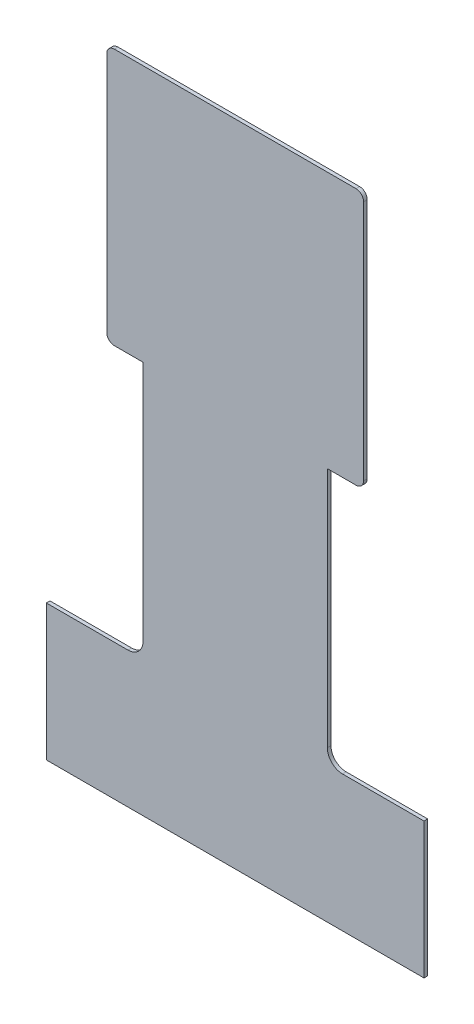
ISO-10303-21;
HEADER;
FILE_DESCRIPTION(('STEP AP214'),'2;1');
FILE_NAME('part.step','',(''),(''),'','','');
FILE_SCHEMA(('AUTOMOTIVE_DESIGN { 1 0 10303 214 1 1 1 1 }'));
ENDSEC;
DATA;
#1=APPLICATION_CONTEXT('core data for automotive mechanical design processes');
#2=APPLICATION_PROTOCOL_DEFINITION('international standard','automotive_design',2000,#1);
#3=PRODUCT_CONTEXT('',#1,'mechanical');
#4=PRODUCT('Part','Part','',(#3));
#5=PRODUCT_RELATED_PRODUCT_CATEGORY('part','',(#4));
#6=PRODUCT_DEFINITION_FORMATION('','',#4);
#7=PRODUCT_DEFINITION_CONTEXT('part definition',#1,'design');
#8=PRODUCT_DEFINITION('design','',#6,#7);
#9=PRODUCT_DEFINITION_SHAPE('','',#8);
#10=(LENGTH_UNIT() NAMED_UNIT(*) SI_UNIT(.MILLI.,.METRE.));
#11=(NAMED_UNIT(*) PLANE_ANGLE_UNIT() SI_UNIT($,.RADIAN.));
#12=(NAMED_UNIT(*) SI_UNIT($,.STERADIAN.) SOLID_ANGLE_UNIT());
#13=UNCERTAINTY_MEASURE_WITH_UNIT(LENGTH_MEASURE(1.E-05),#10,'distance_accuracy_value','');
#14=(GEOMETRIC_REPRESENTATION_CONTEXT(3) GLOBAL_UNCERTAINTY_ASSIGNED_CONTEXT((#13)) GLOBAL_UNIT_ASSIGNED_CONTEXT((#10,
#11,#12)) REPRESENTATION_CONTEXT('',''));
#15=CARTESIAN_POINT('',(0.,0.,0.));
#16=DIRECTION('',(0.,0.,1.));
#17=DIRECTION('',(1.,0.,0.));
#18=AXIS2_PLACEMENT_3D('',#15,#16,#17);
#19=CARTESIAN_POINT('',(0.,5.21544748649932,0.12));
#20=DIRECTION('',(0.,0.,1.));
#21=DIRECTION('',(1.,0.,0.));
#22=AXIS2_PLACEMENT_3D('',#19,#20,#21);
#23=PLANE('',#22);
#24=CARTESIAN_POINT('',(4.,8.75,0.12));
#25=DIRECTION('',(0.,0.,1.));
#26=DIRECTION('',(1.,0.,0.));
#27=AXIS2_PLACEMENT_3D('',#24,#25,#26);
#28=CIRCLE('',#27,0.25);
#29=CARTESIAN_POINT('',(4.25,8.75,0.12));
#30=VERTEX_POINT('',#29);
#31=CARTESIAN_POINT('',(4.,8.5,0.12));
#32=VERTEX_POINT('',#31);
#33=EDGE_CURVE('E325',#30,#32,#28,.F.);
#34=ORIENTED_EDGE('',*,*,#33,.F.);
#35=DIRECTION('',(0.,1.,0.));
#36=VECTOR('',#35,1.);
#37=CARTESIAN_POINT('',(4.25,12.75,0.12));
#38=LINE('',#37,#36);
#39=CARTESIAN_POINT('',(4.25,16.75,0.12));
#40=VERTEX_POINT('',#39);
#41=EDGE_CURVE('E120',#40,#30,#38,.F.);
#42=ORIENTED_EDGE('',*,*,#41,.F.);
#43=CARTESIAN_POINT('',(4.,16.75,0.12));
#44=DIRECTION('',(0.,0.,1.));
#45=DIRECTION('',(1.,0.,0.));
#46=AXIS2_PLACEMENT_3D('',#43,#44,#45);
#47=CIRCLE('',#46,0.25);
#48=CARTESIAN_POINT('',(4.,17.,0.12));
#49=VERTEX_POINT('',#48);
#50=EDGE_CURVE('E22',#40,#49,#47,.T.);
#51=ORIENTED_EDGE('',*,*,#50,.T.);
#52=DIRECTION('',(1.,0.,0.));
#53=VECTOR('',#52,1.);
#54=CARTESIAN_POINT('',(0.,17.,0.12));
#55=LINE('',#54,#53);
#56=CARTESIAN_POINT('',(-4.,17.,0.12));
#57=VERTEX_POINT('',#56);
#58=EDGE_CURVE('E118',#57,#49,#55,.T.);
#59=ORIENTED_EDGE('',*,*,#58,.F.);
#60=CARTESIAN_POINT('',(-4.,16.75,0.12));
#61=DIRECTION('',(0.,0.,1.));
#62=DIRECTION('',(1.,0.,0.));
#63=AXIS2_PLACEMENT_3D('',#60,#61,#62);
#64=CIRCLE('',#63,0.25);
#65=CARTESIAN_POINT('',(-4.25,16.75,0.12));
#66=VERTEX_POINT('',#65);
#67=EDGE_CURVE('E129',#66,#57,#64,.F.);
#68=ORIENTED_EDGE('',*,*,#67,.F.);
#69=DIRECTION('',(0.,1.,0.));
#70=VECTOR('',#69,1.);
#71=CARTESIAN_POINT('',(-4.25,12.75,0.12));
#72=LINE('',#71,#70);
#73=CARTESIAN_POINT('',(-4.25,8.75,0.12));
#74=VERTEX_POINT('',#73);
#75=EDGE_CURVE('E298',#74,#66,#72,.T.);
#76=ORIENTED_EDGE('',*,*,#75,.F.);
#77=CARTESIAN_POINT('',(-4.,8.75,0.12));
#78=DIRECTION('',(0.,0.,1.));
#79=DIRECTION('',(1.,0.,0.));
#80=AXIS2_PLACEMENT_3D('',#77,#78,#79);
#81=CIRCLE('',#80,0.25);
#82=CARTESIAN_POINT('',(-4.,8.5,0.12));
#83=VERTEX_POINT('',#82);
#84=EDGE_CURVE('E301',#83,#74,#81,.F.);
#85=ORIENTED_EDGE('',*,*,#84,.F.);
#86=DIRECTION('',(1.,0.,0.));
#87=VECTOR('',#86,1.);
#88=CARTESIAN_POINT('',(-3.65,8.5,0.12));
#89=LINE('',#88,#87);
#90=CARTESIAN_POINT('',(-3.05,8.5,0.12));
#91=VERTEX_POINT('',#90);
#92=EDGE_CURVE('E289',#91,#83,#89,.F.);
#93=ORIENTED_EDGE('',*,*,#92,.F.);
#94=DIRECTION('',(0.,1.,0.));
#95=VECTOR('',#94,1.);
#96=CARTESIAN_POINT('',(-3.05,4.5,0.12));
#97=LINE('',#96,#95);
#98=CARTESIAN_POINT('',(-3.05,0.5,0.12));
#99=VERTEX_POINT('',#98);
#100=EDGE_CURVE('E285',#99,#91,#97,.T.);
#101=ORIENTED_EDGE('',*,*,#100,.F.);
#102=CARTESIAN_POINT('',(-3.55,0.5,0.12));
#103=DIRECTION('',(0.,0.,1.));
#104=DIRECTION('',(1.,0.,0.));
#105=AXIS2_PLACEMENT_3D('',#102,#103,#104);
#106=CIRCLE('',#105,0.5);
#107=CARTESIAN_POINT('',(-3.55,0.,0.12));
#108=VERTEX_POINT('',#107);
#109=EDGE_CURVE('E232',#99,#108,#106,.F.);
#110=ORIENTED_EDGE('',*,*,#109,.T.);
#111=DIRECTION('',(1.,0.,0.));
#112=VECTOR('',#111,1.);
#113=CARTESIAN_POINT('',(-4.9,0.,0.12));
#114=LINE('',#113,#112);
#115=CARTESIAN_POINT('',(-6.25,0.,0.12));
#116=VERTEX_POINT('',#115);
#117=EDGE_CURVE('E226',#116,#108,#114,.T.);
#118=ORIENTED_EDGE('',*,*,#117,.F.);
#119=DIRECTION('',(0.,1.,0.));
#120=VECTOR('',#119,1.);
#121=CARTESIAN_POINT('',(-6.25,-2.25,0.12));
#122=LINE('',#121,#120);
#123=CARTESIAN_POINT('',(-6.25,-4.5,0.12));
#124=VERTEX_POINT('',#123);
#125=EDGE_CURVE('E220',#124,#116,#122,.T.);
#126=ORIENTED_EDGE('',*,*,#125,.F.);
#127=DIRECTION('',(1.,0.,0.));
#128=VECTOR('',#127,1.);
#129=CARTESIAN_POINT('',(0.,-4.5,0.12));
#130=LINE('',#129,#128);
#131=CARTESIAN_POINT('',(6.25,-4.5,0.12));
#132=VERTEX_POINT('',#131);
#133=EDGE_CURVE('E207',#132,#124,#130,.F.);
#134=ORIENTED_EDGE('',*,*,#133,.F.);
#135=DIRECTION('',(0.,1.,0.));
#136=VECTOR('',#135,1.);
#137=CARTESIAN_POINT('',(6.25,-2.25,0.12));
#138=LINE('',#137,#136);
#139=CARTESIAN_POINT('',(6.25,0.,0.12));
#140=VERTEX_POINT('',#139);
#141=EDGE_CURVE('E193',#140,#132,#138,.F.);
#142=ORIENTED_EDGE('',*,*,#141,.F.);
#143=DIRECTION('',(1.,0.,0.));
#144=VECTOR('',#143,1.);
#145=CARTESIAN_POINT('',(4.9,0.,0.12));
#146=LINE('',#145,#144);
#147=CARTESIAN_POINT('',(3.55,0.,0.12));
#148=VERTEX_POINT('',#147);
#149=EDGE_CURVE('E192',#148,#140,#146,.T.);
#150=ORIENTED_EDGE('',*,*,#149,.F.);
#151=CARTESIAN_POINT('',(3.55,0.5,0.12));
#152=DIRECTION('',(0.,0.,1.));
#153=DIRECTION('',(1.,0.,0.));
#154=AXIS2_PLACEMENT_3D('',#151,#152,#153);
#155=CIRCLE('',#154,0.5);
#156=CARTESIAN_POINT('',(3.05,0.5,0.12));
#157=VERTEX_POINT('',#156);
#158=EDGE_CURVE('E246',#148,#157,#155,.F.);
#159=ORIENTED_EDGE('',*,*,#158,.T.);
#160=DIRECTION('',(0.,1.,0.));
#161=VECTOR('',#160,1.);
#162=CARTESIAN_POINT('',(3.05,4.5,0.12));
#163=LINE('',#162,#161);
#164=CARTESIAN_POINT('',(3.05,8.5,0.12));
#165=VERTEX_POINT('',#164);
#166=EDGE_CURVE('E332',#165,#157,#163,.F.);
#167=ORIENTED_EDGE('',*,*,#166,.F.);
#168=DIRECTION('',(1.,0.,0.));
#169=VECTOR('',#168,1.);
#170=CARTESIAN_POINT('',(3.65,8.5,0.12));
#171=LINE('',#170,#169);
#172=EDGE_CURVE('E350',#32,#165,#171,.F.);
#173=ORIENTED_EDGE('',*,*,#172,.F.);
#174=EDGE_LOOP('',(#34,#42,#51,#59,#68,#76,#85,#93,#101,#110,#118,#126,#134,#142,#150,#159,#167,#173));
#175=FACE_BOUND('',#174,.T.);
#176=ADVANCED_FACE('F19',(#175),#23,.T.);
#177=CARTESIAN_POINT('',(0.,17.,0.));
#178=DIRECTION('',(0.,1.,0.));
#179=DIRECTION('',(0.,0.,1.));
#180=AXIS2_PLACEMENT_3D('',#177,#178,#179);
#181=PLANE('',#180);
#182=DIRECTION('',(0.,0.,1.));
#183=VECTOR('',#182,1.);
#184=CARTESIAN_POINT('',(-4.,17.,0.));
#185=LINE('',#184,#183);
#186=CARTESIAN_POINT('',(-4.,17.,0.));
#187=VERTEX_POINT('',#186);
#188=EDGE_CURVE('E127',#57,#187,#185,.F.);
#189=ORIENTED_EDGE('',*,*,#188,.F.);
#190=ORIENTED_EDGE('',*,*,#58,.T.);
#191=DIRECTION('',(0.,0.,1.));
#192=VECTOR('',#191,1.);
#193=CARTESIAN_POINT('',(4.,17.,0.));
#194=LINE('',#193,#192);
#195=CARTESIAN_POINT('',(4.,17.,0.));
#196=VERTEX_POINT('',#195);
#197=EDGE_CURVE('E126',#196,#49,#194,.T.);
#198=ORIENTED_EDGE('',*,*,#197,.F.);
#199=DIRECTION('',(1.,0.,0.));
#200=VECTOR('',#199,1.);
#201=CARTESIAN_POINT('',(0.,17.,0.));
#202=LINE('',#201,#200);
#203=EDGE_CURVE('E133',#196,#187,#202,.F.);
#204=ORIENTED_EDGE('',*,*,#203,.T.);
#205=EDGE_LOOP('',(#189,#190,#198,#204));
#206=FACE_BOUND('',#205,.T.);
#207=ADVANCED_FACE('F124',(#206),#181,.T.);
#208=CARTESIAN_POINT('',(-4.,16.75,0.));
#209=DIRECTION('',(0.,0.,1.));
#210=DIRECTION('',(1.,0.,0.));
#211=AXIS2_PLACEMENT_3D('',#208,#209,#210);
#212=CYLINDRICAL_SURFACE('',#211,0.25);
#213=CARTESIAN_POINT('',(-4.,16.75,0.));
#214=DIRECTION('',(0.,0.,1.));
#215=DIRECTION('',(1.,0.,0.));
#216=AXIS2_PLACEMENT_3D('',#213,#214,#215);
#217=CIRCLE('',#216,0.25);
#218=CARTESIAN_POINT('',(-4.25,16.75,0.));
#219=VERTEX_POINT('',#218);
#220=EDGE_CURVE('E138',#187,#219,#217,.T.);
#221=ORIENTED_EDGE('',*,*,#220,.T.);
#222=DIRECTION('',(0.,0.,1.));
#223=VECTOR('',#222,1.);
#224=CARTESIAN_POINT('',(-4.25,16.75,0.));
#225=LINE('',#224,#223);
#226=EDGE_CURVE('E302',#66,#219,#225,.F.);
#227=ORIENTED_EDGE('',*,*,#226,.F.);
#228=ORIENTED_EDGE('',*,*,#67,.T.);
#229=ORIENTED_EDGE('',*,*,#188,.T.);
#230=EDGE_LOOP('',(#221,#227,#228,#229));
#231=FACE_BOUND('',#230,.T.);
#232=ADVANCED_FACE('F432',(#231),#212,.T.);
#233=CARTESIAN_POINT('',(-4.25,12.75,0.));
#234=DIRECTION('',(-1.,0.,0.));
#235=DIRECTION('',(0.,0.,1.));
#236=AXIS2_PLACEMENT_3D('',#233,#234,#235);
#237=PLANE('',#236);
#238=DIRECTION('',(0.,0.,1.));
#239=VECTOR('',#238,1.);
#240=CARTESIAN_POINT('',(-4.25,8.75,0.));
#241=LINE('',#240,#239);
#242=CARTESIAN_POINT('',(-4.25,8.75,0.));
#243=VERTEX_POINT('',#242);
#244=EDGE_CURVE('E337',#74,#243,#241,.F.);
#245=ORIENTED_EDGE('',*,*,#244,.F.);
#246=ORIENTED_EDGE('',*,*,#75,.T.);
#247=ORIENTED_EDGE('',*,*,#226,.T.);
#248=DIRECTION('',(0.,1.,0.));
#249=VECTOR('',#248,1.);
#250=CARTESIAN_POINT('',(-4.25,5.21544748649932,0.));
#251=LINE('',#250,#249);
#252=EDGE_CURVE('E320',#219,#243,#251,.F.);
#253=ORIENTED_EDGE('',*,*,#252,.T.);
#254=EDGE_LOOP('',(#245,#246,#247,#253));
#255=FACE_BOUND('',#254,.T.);
#256=ADVANCED_FACE('F431',(#255),#237,.T.);
#257=CARTESIAN_POINT('',(-4.,8.75,0.));
#258=DIRECTION('',(0.,0.,1.));
#259=DIRECTION('',(1.,0.,0.));
#260=AXIS2_PLACEMENT_3D('',#257,#258,#259);
#261=CYLINDRICAL_SURFACE('',#260,0.25);
#262=CARTESIAN_POINT('',(-4.,8.75,0.));
#263=DIRECTION('',(0.,0.,1.));
#264=DIRECTION('',(1.,0.,0.));
#265=AXIS2_PLACEMENT_3D('',#262,#263,#264);
#266=CIRCLE('',#265,0.25);
#267=CARTESIAN_POINT('',(-4.,8.5,0.));
#268=VERTEX_POINT('',#267);
#269=EDGE_CURVE('E315',#243,#268,#266,.T.);
#270=ORIENTED_EDGE('',*,*,#269,.T.);
#271=DIRECTION('',(0.,0.,-1.));
#272=VECTOR('',#271,1.);
#273=CARTESIAN_POINT('',(-4.,8.5,0.));
#274=LINE('',#273,#272);
#275=EDGE_CURVE('E295',#83,#268,#274,.T.);
#276=ORIENTED_EDGE('',*,*,#275,.F.);
#277=ORIENTED_EDGE('',*,*,#84,.T.);
#278=ORIENTED_EDGE('',*,*,#244,.T.);
#279=EDGE_LOOP('',(#270,#276,#277,#278));
#280=FACE_BOUND('',#279,.T.);
#281=ADVANCED_FACE('F439',(#280),#261,.T.);
#282=CARTESIAN_POINT('',(-3.65,8.5,0.));
#283=DIRECTION('',(0.,-1.,0.));
#284=DIRECTION('',(0.,0.,-1.));
#285=AXIS2_PLACEMENT_3D('',#282,#283,#284);
#286=PLANE('',#285);
#287=DIRECTION('',(0.,0.,1.));
#288=VECTOR('',#287,1.);
#289=CARTESIAN_POINT('',(-3.05,8.5,0.));
#290=LINE('',#289,#288);
#291=CARTESIAN_POINT('',(-3.05,8.5,0.));
#292=VERTEX_POINT('',#291);
#293=EDGE_CURVE('E233',#91,#292,#290,.F.);
#294=ORIENTED_EDGE('',*,*,#293,.F.);
#295=ORIENTED_EDGE('',*,*,#92,.T.);
#296=ORIENTED_EDGE('',*,*,#275,.T.);
#297=DIRECTION('',(1.,0.,0.));
#298=VECTOR('',#297,1.);
#299=CARTESIAN_POINT('',(0.,8.5,0.));
#300=LINE('',#299,#298);
#301=EDGE_CURVE('E319',#268,#292,#300,.T.);
#302=ORIENTED_EDGE('',*,*,#301,.T.);
#303=EDGE_LOOP('',(#294,#295,#296,#302));
#304=FACE_BOUND('',#303,.T.);
#305=ADVANCED_FACE('F417',(#304),#286,.T.);
#306=CARTESIAN_POINT('',(-3.05,4.5,0.));
#307=DIRECTION('',(-1.,0.,0.));
#308=DIRECTION('',(0.,0.,1.));
#309=AXIS2_PLACEMENT_3D('',#306,#307,#308);
#310=PLANE('',#309);
#311=DIRECTION('',(0.,1.,0.));
#312=VECTOR('',#311,1.);
#313=CARTESIAN_POINT('',(-3.05,5.21544748649932,0.));
#314=LINE('',#313,#312);
#315=CARTESIAN_POINT('',(-3.05,0.5,0.));
#316=VERTEX_POINT('',#315);
#317=EDGE_CURVE('E314',#292,#316,#314,.F.);
#318=ORIENTED_EDGE('',*,*,#317,.T.);
#319=DIRECTION('',(0.,0.,1.));
#320=VECTOR('',#319,1.);
#321=CARTESIAN_POINT('',(-3.05,0.5,0.));
#322=LINE('',#321,#320);
#323=EDGE_CURVE('E227',#316,#99,#322,.T.);
#324=ORIENTED_EDGE('',*,*,#323,.T.);
#325=ORIENTED_EDGE('',*,*,#100,.T.);
#326=ORIENTED_EDGE('',*,*,#293,.T.);
#327=EDGE_LOOP('',(#318,#324,#325,#326));
#328=FACE_BOUND('',#327,.T.);
#329=ADVANCED_FACE('F406',(#328),#310,.T.);
#330=CARTESIAN_POINT('',(-3.55,0.5,0.));
#331=DIRECTION('',(0.,0.,1.));
#332=DIRECTION('',(1.,0.,0.));
#333=AXIS2_PLACEMENT_3D('',#330,#331,#332);
#334=CYLINDRICAL_SURFACE('',#333,0.5);
#335=ORIENTED_EDGE('',*,*,#323,.F.);
#336=CARTESIAN_POINT('',(-3.55,0.5,0.));
#337=DIRECTION('',(0.,0.,1.));
#338=DIRECTION('',(1.,0.,0.));
#339=AXIS2_PLACEMENT_3D('',#336,#337,#338);
#340=CIRCLE('',#339,0.5);
#341=CARTESIAN_POINT('',(-3.55,0.,0.));
#342=VERTEX_POINT('',#341);
#343=EDGE_CURVE('E311',#316,#342,#340,.F.);
#344=ORIENTED_EDGE('',*,*,#343,.T.);
#345=DIRECTION('',(0.,0.,1.));
#346=VECTOR('',#345,1.);
#347=CARTESIAN_POINT('',(-3.55,0.,0.));
#348=LINE('',#347,#346);
#349=EDGE_CURVE('E223',#108,#342,#348,.F.);
#350=ORIENTED_EDGE('',*,*,#349,.F.);
#351=ORIENTED_EDGE('',*,*,#109,.F.);
#352=EDGE_LOOP('',(#335,#344,#350,#351));
#353=FACE_BOUND('',#352,.T.);
#354=ADVANCED_FACE('F474',(#353),#334,.F.);
#355=CARTESIAN_POINT('',(-4.9,0.,0.));
#356=DIRECTION('',(0.,1.,0.));
#357=DIRECTION('',(0.,0.,1.));
#358=AXIS2_PLACEMENT_3D('',#355,#356,#357);
#359=PLANE('',#358);
#360=DIRECTION('',(1.,0.,0.));
#361=VECTOR('',#360,1.);
#362=CARTESIAN_POINT('',(0.,0.,0.));
#363=LINE('',#362,#361);
#364=CARTESIAN_POINT('',(-6.25,0.,0.));
#365=VERTEX_POINT('',#364);
#366=EDGE_CURVE('E213',#342,#365,#363,.F.);
#367=ORIENTED_EDGE('',*,*,#366,.T.);
#368=DIRECTION('',(0.,0.,1.));
#369=VECTOR('',#368,1.);
#370=CARTESIAN_POINT('',(-6.25,0.,0.));
#371=LINE('',#370,#369);
#372=EDGE_CURVE('E216',#116,#365,#371,.F.);
#373=ORIENTED_EDGE('',*,*,#372,.F.);
#374=ORIENTED_EDGE('',*,*,#117,.T.);
#375=ORIENTED_EDGE('',*,*,#349,.T.);
#376=EDGE_LOOP('',(#367,#373,#374,#375));
#377=FACE_BOUND('',#376,.T.);
#378=ADVANCED_FACE('F471',(#377),#359,.T.);
#379=CARTESIAN_POINT('',(-6.25,-2.25,0.));
#380=DIRECTION('',(-1.,0.,0.));
#381=DIRECTION('',(0.,0.,1.));
#382=AXIS2_PLACEMENT_3D('',#379,#380,#381);
#383=PLANE('',#382);
#384=DIRECTION('',(0.,1.,0.));
#385=VECTOR('',#384,1.);
#386=CARTESIAN_POINT('',(-6.25,5.21544748649932,0.));
#387=LINE('',#386,#385);
#388=CARTESIAN_POINT('',(-6.25,-4.5,0.));
#389=VERTEX_POINT('',#388);
#390=EDGE_CURVE('E199',#365,#389,#387,.F.);
#391=ORIENTED_EDGE('',*,*,#390,.T.);
#392=DIRECTION('',(0.,0.,-1.));
#393=VECTOR('',#392,1.);
#394=CARTESIAN_POINT('',(-6.25,-4.5,0.));
#395=LINE('',#394,#393);
#396=EDGE_CURVE('E202',#124,#389,#395,.T.);
#397=ORIENTED_EDGE('',*,*,#396,.F.);
#398=ORIENTED_EDGE('',*,*,#125,.T.);
#399=ORIENTED_EDGE('',*,*,#372,.T.);
#400=EDGE_LOOP('',(#391,#397,#398,#399));
#401=FACE_BOUND('',#400,.T.);
#402=ADVANCED_FACE('F395',(#401),#383,.T.);
#403=CARTESIAN_POINT('',(0.,-4.5,0.));
#404=DIRECTION('',(0.,-1.,0.));
#405=DIRECTION('',(0.,0.,-1.));
#406=AXIS2_PLACEMENT_3D('',#403,#404,#405);
#407=PLANE('',#406);
#408=DIRECTION('',(1.,0.,0.));
#409=VECTOR('',#408,1.);
#410=CARTESIAN_POINT('',(0.,-4.5,0.));
#411=LINE('',#410,#409);
#412=CARTESIAN_POINT('',(6.25,-4.5,0.));
#413=VERTEX_POINT('',#412);
#414=EDGE_CURVE('E196',#389,#413,#411,.T.);
#415=ORIENTED_EDGE('',*,*,#414,.T.);
#416=DIRECTION('',(0.,0.,-1.));
#417=VECTOR('',#416,1.);
#418=CARTESIAN_POINT('',(6.25,-4.5,0.));
#419=LINE('',#418,#417);
#420=EDGE_CURVE('E187',#132,#413,#419,.T.);
#421=ORIENTED_EDGE('',*,*,#420,.F.);
#422=ORIENTED_EDGE('',*,*,#133,.T.);
#423=ORIENTED_EDGE('',*,*,#396,.T.);
#424=EDGE_LOOP('',(#415,#421,#422,#423));
#425=FACE_BOUND('',#424,.T.);
#426=ADVANCED_FACE('F387',(#425),#407,.T.);
#427=CARTESIAN_POINT('',(6.25,-2.25,0.));
#428=DIRECTION('',(1.,0.,0.));
#429=DIRECTION('',(0.,0.,-1.));
#430=AXIS2_PLACEMENT_3D('',#427,#428,#429);
#431=PLANE('',#430);
#432=DIRECTION('',(0.,1.,0.));
#433=VECTOR('',#432,1.);
#434=CARTESIAN_POINT('',(6.25,5.21544748649932,0.));
#435=LINE('',#434,#433);
#436=CARTESIAN_POINT('',(6.25,0.,0.));
#437=VERTEX_POINT('',#436);
#438=EDGE_CURVE('E185',#413,#437,#435,.T.);
#439=ORIENTED_EDGE('',*,*,#438,.T.);
#440=DIRECTION('',(0.,0.,1.));
#441=VECTOR('',#440,1.);
#442=CARTESIAN_POINT('',(6.25,0.,0.));
#443=LINE('',#442,#441);
#444=EDGE_CURVE('E247',#140,#437,#443,.F.);
#445=ORIENTED_EDGE('',*,*,#444,.F.);
#446=ORIENTED_EDGE('',*,*,#141,.T.);
#447=ORIENTED_EDGE('',*,*,#420,.T.);
#448=EDGE_LOOP('',(#439,#445,#446,#447));
#449=FACE_BOUND('',#448,.T.);
#450=ADVANCED_FACE('F378',(#449),#431,.T.);
#451=CARTESIAN_POINT('',(4.9,0.,0.));
#452=DIRECTION('',(0.,1.,0.));
#453=DIRECTION('',(0.,0.,1.));
#454=AXIS2_PLACEMENT_3D('',#451,#452,#453);
#455=PLANE('',#454);
#456=DIRECTION('',(1.,0.,0.));
#457=VECTOR('',#456,1.);
#458=CARTESIAN_POINT('',(0.,0.,0.));
#459=LINE('',#458,#457);
#460=CARTESIAN_POINT('',(3.55,0.,0.));
#461=VERTEX_POINT('',#460);
#462=EDGE_CURVE('E175',#437,#461,#459,.F.);
#463=ORIENTED_EDGE('',*,*,#462,.T.);
#464=DIRECTION('',(0.,0.,1.));
#465=VECTOR('',#464,1.);
#466=CARTESIAN_POINT('',(3.55,0.,0.));
#467=LINE('',#466,#465);
#468=EDGE_CURVE('E240',#461,#148,#467,.T.);
#469=ORIENTED_EDGE('',*,*,#468,.T.);
#470=ORIENTED_EDGE('',*,*,#149,.T.);
#471=ORIENTED_EDGE('',*,*,#444,.T.);
#472=EDGE_LOOP('',(#463,#469,#470,#471));
#473=FACE_BOUND('',#472,.T.);
#474=ADVANCED_FACE('F372',(#473),#455,.T.);
#475=CARTESIAN_POINT('',(3.55,0.5,0.));
#476=DIRECTION('',(0.,0.,1.));
#477=DIRECTION('',(1.,0.,0.));
#478=AXIS2_PLACEMENT_3D('',#475,#476,#477);
#479=CYLINDRICAL_SURFACE('',#478,0.5);
#480=ORIENTED_EDGE('',*,*,#468,.F.);
#481=CARTESIAN_POINT('',(3.55,0.5,0.));
#482=DIRECTION('',(0.,0.,1.));
#483=DIRECTION('',(1.,0.,0.));
#484=AXIS2_PLACEMENT_3D('',#481,#482,#483);
#485=CIRCLE('',#484,0.5);
#486=CARTESIAN_POINT('',(3.05,0.5,0.));
#487=VERTEX_POINT('',#486);
#488=EDGE_CURVE('E172',#461,#487,#485,.F.);
#489=ORIENTED_EDGE('',*,*,#488,.T.);
#490=DIRECTION('',(0.,0.,-1.));
#491=VECTOR('',#490,1.);
#492=CARTESIAN_POINT('',(3.05,0.5,0.));
#493=LINE('',#492,#491);
#494=EDGE_CURVE('E248',#157,#487,#493,.T.);
#495=ORIENTED_EDGE('',*,*,#494,.F.);
#496=ORIENTED_EDGE('',*,*,#158,.F.);
#497=EDGE_LOOP('',(#480,#489,#495,#496));
#498=FACE_BOUND('',#497,.T.);
#499=ADVANCED_FACE('F371',(#498),#479,.F.);
#500=CARTESIAN_POINT('',(3.05,4.5,0.));
#501=DIRECTION('',(1.,0.,0.));
#502=DIRECTION('',(0.,0.,-1.));
#503=AXIS2_PLACEMENT_3D('',#500,#501,#502);
#504=PLANE('',#503);
#505=DIRECTION('',(0.,1.,0.));
#506=VECTOR('',#505,1.);
#507=CARTESIAN_POINT('',(3.05,5.21544748649932,0.));
#508=LINE('',#507,#506);
#509=CARTESIAN_POINT('',(3.05,8.5,0.));
#510=VERTEX_POINT('',#509);
#511=EDGE_CURVE('E166',#487,#510,#508,.T.);
#512=ORIENTED_EDGE('',*,*,#511,.T.);
#513=DIRECTION('',(0.,0.,-1.));
#514=VECTOR('',#513,1.);
#515=CARTESIAN_POINT('',(3.05,8.5,0.));
#516=LINE('',#515,#514);
#517=EDGE_CURVE('E328',#165,#510,#516,.T.);
#518=ORIENTED_EDGE('',*,*,#517,.F.);
#519=ORIENTED_EDGE('',*,*,#166,.T.);
#520=ORIENTED_EDGE('',*,*,#494,.T.);
#521=EDGE_LOOP('',(#512,#518,#519,#520));
#522=FACE_BOUND('',#521,.T.);
#523=ADVANCED_FACE('F362',(#522),#504,.T.);
#524=CARTESIAN_POINT('',(3.65,8.5,0.));
#525=DIRECTION('',(0.,-1.,0.));
#526=DIRECTION('',(0.,0.,-1.));
#527=AXIS2_PLACEMENT_3D('',#524,#525,#526);
#528=PLANE('',#527);
#529=ORIENTED_EDGE('',*,*,#517,.T.);
#530=DIRECTION('',(1.,0.,0.));
#531=VECTOR('',#530,1.);
#532=CARTESIAN_POINT('',(0.,8.5,0.));
#533=LINE('',#532,#531);
#534=CARTESIAN_POINT('',(4.,8.5,0.));
#535=VERTEX_POINT('',#534);
#536=EDGE_CURVE('E162',#510,#535,#533,.T.);
#537=ORIENTED_EDGE('',*,*,#536,.T.);
#538=DIRECTION('',(0.,0.,1.));
#539=VECTOR('',#538,1.);
#540=CARTESIAN_POINT('',(4.,8.5,0.));
#541=LINE('',#540,#539);
#542=EDGE_CURVE('E146',#32,#535,#541,.F.);
#543=ORIENTED_EDGE('',*,*,#542,.F.);
#544=ORIENTED_EDGE('',*,*,#172,.T.);
#545=EDGE_LOOP('',(#529,#537,#543,#544));
#546=FACE_BOUND('',#545,.T.);
#547=ADVANCED_FACE('F454',(#546),#528,.T.);
#548=CARTESIAN_POINT('',(4.,8.75,0.));
#549=DIRECTION('',(0.,0.,1.));
#550=DIRECTION('',(1.,0.,0.));
#551=AXIS2_PLACEMENT_3D('',#548,#549,#550);
#552=CYLINDRICAL_SURFACE('',#551,0.25);
#553=CARTESIAN_POINT('',(4.,8.75,0.));
#554=DIRECTION('',(0.,0.,1.));
#555=DIRECTION('',(1.,0.,0.));
#556=AXIS2_PLACEMENT_3D('',#553,#554,#555);
#557=CIRCLE('',#556,0.25);
#558=CARTESIAN_POINT('',(4.25,8.75,0.));
#559=VERTEX_POINT('',#558);
#560=EDGE_CURVE('E161',#535,#559,#557,.T.);
#561=ORIENTED_EDGE('',*,*,#560,.T.);
#562=DIRECTION('',(0.,0.,-1.));
#563=VECTOR('',#562,1.);
#564=CARTESIAN_POINT('',(4.25,8.75,0.));
#565=LINE('',#564,#563);
#566=EDGE_CURVE('E140',#30,#559,#565,.T.);
#567=ORIENTED_EDGE('',*,*,#566,.F.);
#568=ORIENTED_EDGE('',*,*,#33,.T.);
#569=ORIENTED_EDGE('',*,*,#542,.T.);
#570=EDGE_LOOP('',(#561,#567,#568,#569));
#571=FACE_BOUND('',#570,.T.);
#572=ADVANCED_FACE('F450',(#571),#552,.T.);
#573=CARTESIAN_POINT('',(4.25,12.75,0.));
#574=DIRECTION('',(1.,0.,0.));
#575=DIRECTION('',(0.,0.,-1.));
#576=AXIS2_PLACEMENT_3D('',#573,#574,#575);
#577=PLANE('',#576);
#578=ORIENTED_EDGE('',*,*,#566,.T.);
#579=DIRECTION('',(0.,1.,0.));
#580=VECTOR('',#579,1.);
#581=CARTESIAN_POINT('',(4.25,5.21544748649932,0.));
#582=LINE('',#581,#580);
#583=CARTESIAN_POINT('',(4.25,16.75,0.));
#584=VERTEX_POINT('',#583);
#585=EDGE_CURVE('E29',#559,#584,#582,.T.);
#586=ORIENTED_EDGE('',*,*,#585,.T.);
#587=DIRECTION('',(0.,0.,1.));
#588=VECTOR('',#587,1.);
#589=CARTESIAN_POINT('',(4.25,16.75,0.));
#590=LINE('',#589,#588);
#591=EDGE_CURVE('E36',#40,#584,#590,.F.);
#592=ORIENTED_EDGE('',*,*,#591,.F.);
#593=ORIENTED_EDGE('',*,*,#41,.T.);
#594=EDGE_LOOP('',(#578,#586,#592,#593));
#595=FACE_BOUND('',#594,.T.);
#596=ADVANCED_FACE('F445',(#595),#577,.T.);
#597=CARTESIAN_POINT('',(4.,16.75,0.));
#598=DIRECTION('',(0.,0.,1.));
#599=DIRECTION('',(1.,0.,0.));
#600=AXIS2_PLACEMENT_3D('',#597,#598,#599);
#601=CYLINDRICAL_SURFACE('',#600,0.25);
#602=CARTESIAN_POINT('',(4.,16.75,0.));
#603=DIRECTION('',(0.,0.,1.));
#604=DIRECTION('',(1.,0.,0.));
#605=AXIS2_PLACEMENT_3D('',#602,#603,#604);
#606=CIRCLE('',#605,0.25);
#607=EDGE_CURVE('E12',#584,#196,#606,.T.);
#608=ORIENTED_EDGE('',*,*,#607,.T.);
#609=ORIENTED_EDGE('',*,*,#197,.T.);
#610=ORIENTED_EDGE('',*,*,#50,.F.);
#611=ORIENTED_EDGE('',*,*,#591,.T.);
#612=EDGE_LOOP('',(#608,#609,#610,#611));
#613=FACE_BOUND('',#612,.T.);
#614=ADVANCED_FACE('F131',(#613),#601,.T.);
#615=CARTESIAN_POINT('',(0.,5.21544748649932,0.));
#616=DIRECTION('',(0.,0.,1.));
#617=DIRECTION('',(1.,0.,0.));
#618=AXIS2_PLACEMENT_3D('',#615,#616,#617);
#619=PLANE('',#618);
#620=ORIENTED_EDGE('',*,*,#585,.F.);
#621=ORIENTED_EDGE('',*,*,#560,.F.);
#622=ORIENTED_EDGE('',*,*,#536,.F.);
#623=ORIENTED_EDGE('',*,*,#511,.F.);
#624=ORIENTED_EDGE('',*,*,#488,.F.);
#625=ORIENTED_EDGE('',*,*,#462,.F.);
#626=ORIENTED_EDGE('',*,*,#438,.F.);
#627=ORIENTED_EDGE('',*,*,#414,.F.);
#628=ORIENTED_EDGE('',*,*,#390,.F.);
#629=ORIENTED_EDGE('',*,*,#366,.F.);
#630=ORIENTED_EDGE('',*,*,#343,.F.);
#631=ORIENTED_EDGE('',*,*,#317,.F.);
#632=ORIENTED_EDGE('',*,*,#301,.F.);
#633=ORIENTED_EDGE('',*,*,#269,.F.);
#634=ORIENTED_EDGE('',*,*,#252,.F.);
#635=ORIENTED_EDGE('',*,*,#220,.F.);
#636=ORIENTED_EDGE('',*,*,#203,.F.);
#637=ORIENTED_EDGE('',*,*,#607,.F.);
#638=EDGE_LOOP('',(#620,#621,#622,#623,#624,#625,#626,#627,#628,#629,#630,#631,#632,#633,#634,
#635,#636,#637));
#639=FACE_BOUND('',#638,.T.);
#640=ADVANCED_FACE('F369',(#639),#619,.F.);
#641=CLOSED_SHELL('',(#176,#207,#232,#256,#281,#305,#329,#354,#378,#402,#426,#450,#474,#499,
#523,#547,#572,#596,#614,#640));
#642=MANIFOLD_SOLID_BREP('B1',#641);
#643=ADVANCED_BREP_SHAPE_REPRESENTATION('',(#18,#642),#14);
#644=SHAPE_DEFINITION_REPRESENTATION(#9,#643);
ENDSEC;
END-ISO-10303-21;
